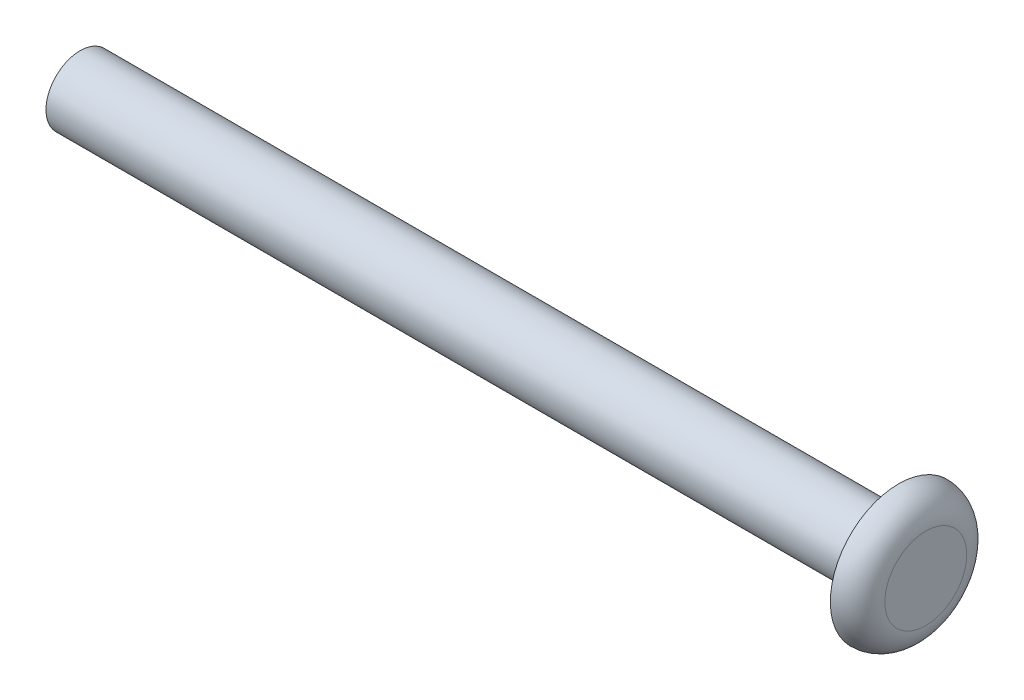
ISO-10303-21;
HEADER;
FILE_DESCRIPTION(('STEP AP214'),'2;1');
FILE_NAME('part.step','',(''),(''),'','','');
FILE_SCHEMA(('AUTOMOTIVE_DESIGN { 1 0 10303 214 1 1 1 1 }'));
ENDSEC;
DATA;
#1=APPLICATION_CONTEXT('core data for automotive mechanical design processes');
#2=APPLICATION_PROTOCOL_DEFINITION('international standard','automotive_design',2000,#1);
#3=PRODUCT_CONTEXT('',#1,'mechanical');
#4=PRODUCT('Part','Part','',(#3));
#5=PRODUCT_RELATED_PRODUCT_CATEGORY('part','',(#4));
#6=PRODUCT_DEFINITION_FORMATION('','',#4);
#7=PRODUCT_DEFINITION_CONTEXT('part definition',#1,'design');
#8=PRODUCT_DEFINITION('design','',#6,#7);
#9=PRODUCT_DEFINITION_SHAPE('','',#8);
#10=(LENGTH_UNIT() NAMED_UNIT(*) SI_UNIT(.MILLI.,.METRE.));
#11=(NAMED_UNIT(*) PLANE_ANGLE_UNIT() SI_UNIT($,.RADIAN.));
#12=(NAMED_UNIT(*) SI_UNIT($,.STERADIAN.) SOLID_ANGLE_UNIT());
#13=UNCERTAINTY_MEASURE_WITH_UNIT(LENGTH_MEASURE(1.E-05),#10,'distance_accuracy_value','');
#14=(GEOMETRIC_REPRESENTATION_CONTEXT(3) GLOBAL_UNCERTAINTY_ASSIGNED_CONTEXT((#13)) GLOBAL_UNIT_ASSIGNED_CONTEXT((#10,
#11,#12)) REPRESENTATION_CONTEXT('',''));
#15=CARTESIAN_POINT('',(0.,0.,0.));
#16=DIRECTION('',(0.,0.,1.));
#17=DIRECTION('',(1.,0.,0.));
#18=AXIS2_PLACEMENT_3D('',#15,#16,#17);
#19=CARTESIAN_POINT('',(0.,3.81,0.));
#20=DIRECTION('',(1.,0.,0.));
#21=DIRECTION('',(0.,1.,0.));
#22=AXIS2_PLACEMENT_3D('',#19,#20,#21);
#23=PLANE('',#22);
#24=CARTESIAN_POINT('',(0.,0.,0.));
#25=DIRECTION('',(1.,0.,0.));
#26=DIRECTION('',(0.,1.,0.));
#27=AXIS2_PLACEMENT_3D('',#24,#25,#26);
#28=CIRCLE('',#27,3.81);
#29=CARTESIAN_POINT('',(0.,3.81,0.));
#30=VERTEX_POINT('',#29);
#31=EDGE_CURVE('E48',#30,#30,#28,.T.);
#32=ORIENTED_EDGE('',*,*,#31,.T.);
#33=EDGE_LOOP('',(#32));
#34=FACE_BOUND('',#33,.T.);
#35=ADVANCED_FACE('F34',(#34),#23,.T.);
#36=CARTESIAN_POINT('',(-78.74,0.,0.));
#37=DIRECTION('',(-1.,0.,0.));
#38=DIRECTION('',(0.,-1.,0.));
#39=AXIS2_PLACEMENT_3D('',#36,#37,#38);
#40=PLANE('',#39);
#41=CARTESIAN_POINT('',(-78.74,0.,0.));
#42=DIRECTION('',(1.,0.,0.));
#43=DIRECTION('',(0.,1.,0.));
#44=AXIS2_PLACEMENT_3D('',#41,#42,#43);
#45=CIRCLE('',#44,3.17500000000001);
#46=CARTESIAN_POINT('',(-78.74,3.175,0.));
#47=VERTEX_POINT('',#46);
#48=EDGE_CURVE('E10',#47,#47,#45,.T.);
#49=ORIENTED_EDGE('',*,*,#48,.F.);
#50=EDGE_LOOP('',(#49));
#51=FACE_BOUND('',#50,.T.);
#52=ADVANCED_FACE('F66',(#51),#40,.T.);
#53=CARTESIAN_POINT('',(0.,0.,0.));
#54=DIRECTION('',(1.,0.,0.));
#55=DIRECTION('',(0.,1.,0.));
#56=AXIS2_PLACEMENT_3D('',#53,#54,#55);
#57=CYLINDRICAL_SURFACE('',#56,3.175);
#58=ORIENTED_EDGE('',*,*,#48,.T.);
#59=EDGE_LOOP('',(#58));
#60=FACE_BOUND('',#59,.T.);
#61=CARTESIAN_POINT('',(-2.54,0.,0.));
#62=DIRECTION('',(1.,0.,0.));
#63=DIRECTION('',(0.,1.,0.));
#64=AXIS2_PLACEMENT_3D('',#61,#62,#63);
#65=CIRCLE('',#64,3.175);
#66=CARTESIAN_POINT('',(-2.54,3.175,0.));
#67=VERTEX_POINT('',#66);
#68=EDGE_CURVE('E40',#67,#67,#65,.T.);
#69=ORIENTED_EDGE('',*,*,#68,.F.);
#70=EDGE_LOOP('',(#69));
#71=FACE_BOUND('',#70,.T.);
#72=ADVANCED_FACE('F63',(#60,#71),#57,.T.);
#73=CARTESIAN_POINT('',(-2.54,3.175,0.));
#74=DIRECTION('',(-1.,0.,0.));
#75=DIRECTION('',(0.,-1.,0.));
#76=AXIS2_PLACEMENT_3D('',#73,#74,#75);
#77=PLANE('',#76);
#78=ORIENTED_EDGE('',*,*,#68,.T.);
#79=EDGE_LOOP('',(#78));
#80=FACE_BOUND('',#79,.T.);
#81=CARTESIAN_POINT('',(-2.54,0.,0.));
#82=DIRECTION('',(1.,0.,0.));
#83=DIRECTION('',(0.,1.,0.));
#84=AXIS2_PLACEMENT_3D('',#81,#82,#83);
#85=CIRCLE('',#84,6.35);
#86=CARTESIAN_POINT('',(-2.54,6.35,0.));
#87=VERTEX_POINT('',#86);
#88=EDGE_CURVE('E44',#87,#87,#85,.T.);
#89=ORIENTED_EDGE('',*,*,#88,.F.);
#90=EDGE_LOOP('',(#89));
#91=FACE_BOUND('',#90,.T.);
#92=ADVANCED_FACE('F57',(#80,#91),#77,.T.);
#93=CARTESIAN_POINT('',(-2.54,0.,0.));
#94=DIRECTION('',(1.,0.,0.));
#95=DIRECTION('',(0.,1.,0.));
#96=AXIS2_PLACEMENT_3D('',#93,#94,#95);
#97=TOROIDAL_SURFACE('',#96,3.81,2.54);
#98=ORIENTED_EDGE('',*,*,#88,.T.);
#99=EDGE_LOOP('',(#98));
#100=FACE_BOUND('',#99,.T.);
#101=ORIENTED_EDGE('',*,*,#31,.F.);
#102=EDGE_LOOP('',(#101));
#103=FACE_BOUND('',#102,.T.);
#104=ADVANCED_FACE('F55',(#100,#103),#97,.T.);
#105=CLOSED_SHELL('',(#35,#52,#72,#92,#104));
#106=MANIFOLD_SOLID_BREP('B2',#105);
#107=ADVANCED_BREP_SHAPE_REPRESENTATION('',(#18,#106),#14);
#108=SHAPE_DEFINITION_REPRESENTATION(#9,#107);
ENDSEC;
END-ISO-10303-21;
